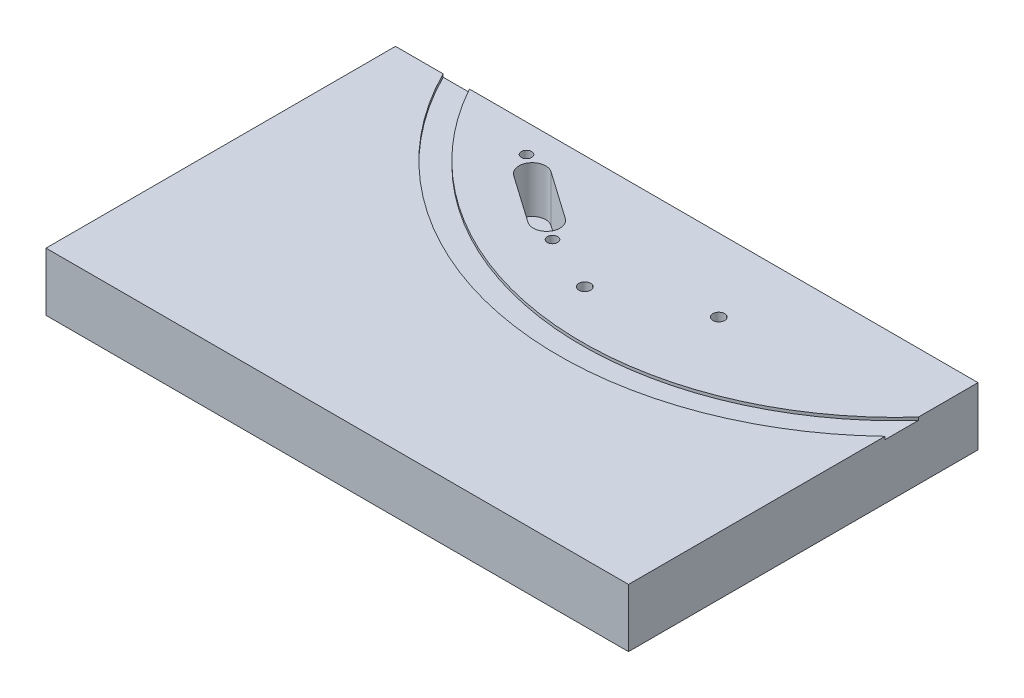
ISO-10303-21;
HEADER;
FILE_DESCRIPTION(('STEP AP214'),'2;1');
FILE_NAME('part.step','',(''),(''),'','','');
FILE_SCHEMA(('AUTOMOTIVE_DESIGN { 1 0 10303 214 1 1 1 1 }'));
ENDSEC;
DATA;
#1=APPLICATION_CONTEXT('core data for automotive mechanical design processes');
#2=APPLICATION_PROTOCOL_DEFINITION('international standard','automotive_design',2000,#1);
#3=PRODUCT_CONTEXT('',#1,'mechanical');
#4=PRODUCT('Part','Part','',(#3));
#5=PRODUCT_RELATED_PRODUCT_CATEGORY('part','',(#4));
#6=PRODUCT_DEFINITION_FORMATION('','',#4);
#7=PRODUCT_DEFINITION_CONTEXT('part definition',#1,'design');
#8=PRODUCT_DEFINITION('design','',#6,#7);
#9=PRODUCT_DEFINITION_SHAPE('','',#8);
#10=(LENGTH_UNIT() NAMED_UNIT(*) SI_UNIT(.MILLI.,.METRE.));
#11=(NAMED_UNIT(*) PLANE_ANGLE_UNIT() SI_UNIT($,.RADIAN.));
#12=(NAMED_UNIT(*) SI_UNIT($,.STERADIAN.) SOLID_ANGLE_UNIT());
#13=UNCERTAINTY_MEASURE_WITH_UNIT(LENGTH_MEASURE(1.E-05),#10,'distance_accuracy_value','');
#14=(GEOMETRIC_REPRESENTATION_CONTEXT(3) GLOBAL_UNCERTAINTY_ASSIGNED_CONTEXT((#13)) GLOBAL_UNIT_ASSIGNED_CONTEXT((#10,
#11,#12)) REPRESENTATION_CONTEXT('',''));
#15=CARTESIAN_POINT('',(0.,0.,0.));
#16=DIRECTION('',(0.,0.,1.));
#17=DIRECTION('',(1.,0.,0.));
#18=AXIS2_PLACEMENT_3D('',#15,#16,#17);
#19=CARTESIAN_POINT('',(0.,10.,0.));
#20=DIRECTION('',(0.,1.,0.));
#21=DIRECTION('',(0.,0.,1.));
#22=AXIS2_PLACEMENT_3D('',#19,#20,#21);
#23=PLANE('',#22);
#24=CARTESIAN_POINT('',(60.,10.,-26.));
#25=DIRECTION('',(0.,1.,0.));
#26=DIRECTION('',(0.,0.,-1.));
#27=AXIS2_PLACEMENT_3D('',#24,#25,#26);
#28=CIRCLE('',#27,57.975);
#29=CARTESIAN_POINT('',(8.182043411574,10.,0.));
#30=VERTEX_POINT('',#29);
#31=CARTESIAN_POINT('',(100.,10.,15.9654694361924));
#32=VERTEX_POINT('',#31);
#33=EDGE_CURVE('E160',#30,#32,#28,.T.);
#34=ORIENTED_EDGE('',*,*,#33,.F.);
#35=DIRECTION('',(-1.,0.,0.));
#36=VECTOR('',#35,1.);
#37=CARTESIAN_POINT('',(0.,10.,0.));
#38=LINE('',#37,#36);
#39=CARTESIAN_POINT('',(0.,10.,0.));
#40=VERTEX_POINT('',#39);
#41=EDGE_CURVE('E249',#30,#40,#38,.T.);
#42=ORIENTED_EDGE('',*,*,#41,.T.);
#43=DIRECTION('',(0.,0.,1.));
#44=VECTOR('',#43,1.);
#45=CARTESIAN_POINT('',(0.,10.,0.));
#46=LINE('',#45,#44);
#47=CARTESIAN_POINT('',(0.,10.,60.));
#48=VERTEX_POINT('',#47);
#49=EDGE_CURVE('E240',#40,#48,#46,.T.);
#50=ORIENTED_EDGE('',*,*,#49,.T.);
#51=DIRECTION('',(1.,0.,0.));
#52=VECTOR('',#51,1.);
#53=CARTESIAN_POINT('',(0.,10.,60.));
#54=LINE('',#53,#52);
#55=CARTESIAN_POINT('',(100.,10.,60.));
#56=VERTEX_POINT('',#55);
#57=EDGE_CURVE('E243',#48,#56,#54,.T.);
#58=ORIENTED_EDGE('',*,*,#57,.T.);
#59=DIRECTION('',(0.,0.,-1.));
#60=VECTOR('',#59,1.);
#61=CARTESIAN_POINT('',(100.,10.,0.));
#62=LINE('',#61,#60);
#63=EDGE_CURVE('E246',#56,#32,#62,.T.);
#64=ORIENTED_EDGE('',*,*,#63,.T.);
#65=EDGE_LOOP('',(#34,#42,#50,#58,#64));
#66=FACE_BOUND('',#65,.T.);
#67=ADVANCED_FACE('F38',(#66),#23,.T.);
#68=CARTESIAN_POINT('',(68.,10.,12.5));
#69=DIRECTION('',(0.,1.,0.));
#70=DIRECTION('',(0.,0.,1.));
#71=AXIS2_PLACEMENT_3D('',#68,#69,#70);
#72=CIRCLE('',#71,1.025);
#73=CARTESIAN_POINT('',(68.,10.,13.525));
#74=VERTEX_POINT('',#73);
#75=EDGE_CURVE('E233',#74,#74,#72,.T.);
#76=ORIENTED_EDGE('',*,*,#75,.F.);
#77=EDGE_LOOP('',(#76));
#78=FACE_BOUND('',#77,.T.);
#79=CARTESIAN_POINT('',(52.,10.,19.5));
#80=DIRECTION('',(0.,1.,0.));
#81=DIRECTION('',(0.,0.,1.));
#82=AXIS2_PLACEMENT_3D('',#79,#80,#81);
#83=CIRCLE('',#82,1.025);
#84=CARTESIAN_POINT('',(52.,10.,20.525));
#85=VERTEX_POINT('',#84);
#86=EDGE_CURVE('E227',#85,#85,#83,.T.);
#87=ORIENTED_EDGE('',*,*,#86,.F.);
#88=EDGE_LOOP('',(#87));
#89=FACE_BOUND('',#88,.T.);
#90=CARTESIAN_POINT('',(27.324326662388,10.,4.83432911843016));
#91=DIRECTION('',(0.,1.,0.));
#92=DIRECTION('',(0.,0.,1.));
#93=AXIS2_PLACEMENT_3D('',#90,#91,#92);
#94=CIRCLE('',#93,0.889000000000001);
#95=CARTESIAN_POINT('',(27.324326662388,10.,5.72332911843016));
#96=VERTEX_POINT('',#95);
#97=EDGE_CURVE('E221',#96,#96,#94,.T.);
#98=ORIENTED_EDGE('',*,*,#97,.F.);
#99=EDGE_LOOP('',(#98));
#100=FACE_BOUND('',#99,.T.);
#101=CARTESIAN_POINT('',(42.2009469387204,10.,15.2510507790014));
#102=DIRECTION('',(0.,1.,0.));
#103=DIRECTION('',(0.,0.,1.));
#104=AXIS2_PLACEMENT_3D('',#101,#102,#103);
#105=CIRCLE('',#104,0.889000000000001);
#106=CARTESIAN_POINT('',(42.2009469387204,10.,16.1400507790014));
#107=VERTEX_POINT('',#106);
#108=EDGE_CURVE('E210',#107,#107,#105,.T.);
#109=ORIENTED_EDGE('',*,*,#108,.F.);
#110=EDGE_LOOP('',(#109));
#111=FACE_BOUND('',#110,.T.);
#112=CARTESIAN_POINT('',(38.8583970219992,10.,12.910572130471));
#113=DIRECTION('',(0.,1.,0.));
#114=DIRECTION('',(0.,0.,1.));
#115=AXIS2_PLACEMENT_3D('',#112,#113,#114);
#116=CIRCLE('',#115,2.3);
#117=CARTESIAN_POINT('',(37.5391712183918,10.,14.7946218323357));
#118=VERTEX_POINT('',#117);
#119=CARTESIAN_POINT('',(40.1776228256065,10.,11.0265224286063));
#120=VERTEX_POINT('',#119);
#121=EDGE_CURVE('E61',#118,#120,#116,.T.);
#122=ORIENTED_EDGE('',*,*,#121,.F.);
#123=DIRECTION('',(0.819152044288995,0.,0.573576436351041));
#124=VECTOR('',#123,1.);
#125=CARTESIAN_POINT('',(37.5391712183918,10.,14.7946218323357));
#126=LINE('',#125,#124);
#127=CARTESIAN_POINT('',(29.3476507755018,10.,9.05885746882527));
#128=VERTEX_POINT('',#127);
#129=EDGE_CURVE('E189',#128,#118,#126,.T.);
#130=ORIENTED_EDGE('',*,*,#129,.F.);
#131=CARTESIAN_POINT('',(30.6668765791092,10.,7.17480776696058));
#132=DIRECTION('',(0.,1.,0.));
#133=DIRECTION('',(0.,0.,1.));
#134=AXIS2_PLACEMENT_3D('',#131,#132,#133);
#135=CIRCLE('',#134,2.3);
#136=CARTESIAN_POINT('',(31.9861023827166,10.,5.29075806509589));
#137=VERTEX_POINT('',#136);
#138=EDGE_CURVE('E203',#137,#128,#135,.T.);
#139=ORIENTED_EDGE('',*,*,#138,.F.);
#140=DIRECTION('',(-0.819152044288995,0.,-0.573576436351041));
#141=VECTOR('',#140,1.);
#142=CARTESIAN_POINT('',(40.1776228256065,10.,11.0265224286063));
#143=LINE('',#142,#141);
#144=EDGE_CURVE('E200',#120,#137,#143,.T.);
#145=ORIENTED_EDGE('',*,*,#144,.F.);
#146=EDGE_LOOP('',(#122,#130,#139,#145));
#147=FACE_BOUND('',#146,.T.);
#148=CARTESIAN_POINT('',(60.,10.,-26.));
#149=DIRECTION('',(0.,-1.,0.));
#150=DIRECTION('',(0.,0.,-1.));
#151=AXIS2_PLACEMENT_3D('',#148,#149,#150);
#152=CIRCLE('',#151,53.975);
#153=CARTESIAN_POINT('',(100.,10.,10.2394898556809));
#154=VERTEX_POINT('',#153);
#155=CARTESIAN_POINT('',(12.6998876851228,10.,0.));
#156=VERTEX_POINT('',#155);
#157=EDGE_CURVE('E289',#154,#156,#152,.T.);
#158=ORIENTED_EDGE('',*,*,#157,.F.);
#159=CARTESIAN_POINT('',(100.,10.,0.));
#160=VERTEX_POINT('',#159);
#161=EDGE_CURVE('E165',#154,#160,#62,.T.);
#162=ORIENTED_EDGE('',*,*,#161,.T.);
#163=EDGE_CURVE('E250',#160,#156,#38,.T.);
#164=ORIENTED_EDGE('',*,*,#163,.T.);
#165=EDGE_LOOP('',(#158,#162,#164));
#166=FACE_BOUND('',#165,.T.);
#167=ADVANCED_FACE('F288',(#78,#89,#100,#111,#147,#166),#23,.T.);
#168=CARTESIAN_POINT('',(0.,10.,0.));
#169=DIRECTION('',(1.,0.,0.));
#170=DIRECTION('',(0.,0.,-1.));
#171=AXIS2_PLACEMENT_3D('',#168,#169,#170);
#172=PLANE('',#171);
#173=DIRECTION('',(0.,0.,1.));
#174=VECTOR('',#173,1.);
#175=CARTESIAN_POINT('',(0.,0.,0.));
#176=LINE('',#175,#174);
#177=CARTESIAN_POINT('',(0.,0.,0.));
#178=VERTEX_POINT('',#177);
#179=CARTESIAN_POINT('',(0.,0.,60.));
#180=VERTEX_POINT('',#179);
#181=EDGE_CURVE('E239',#178,#180,#176,.T.);
#182=ORIENTED_EDGE('',*,*,#181,.T.);
#183=DIRECTION('',(0.,-1.,0.));
#184=VECTOR('',#183,1.);
#185=CARTESIAN_POINT('',(0.,10.,60.));
#186=LINE('',#185,#184);
#187=EDGE_CURVE('E46',#48,#180,#186,.T.);
#188=ORIENTED_EDGE('',*,*,#187,.F.);
#189=ORIENTED_EDGE('',*,*,#49,.F.);
#190=DIRECTION('',(0.,-1.,0.));
#191=VECTOR('',#190,1.);
#192=CARTESIAN_POINT('',(0.,10.,0.));
#193=LINE('',#192,#191);
#194=EDGE_CURVE('E253',#40,#178,#193,.T.);
#195=ORIENTED_EDGE('',*,*,#194,.T.);
#196=EDGE_LOOP('',(#182,#188,#189,#195));
#197=FACE_BOUND('',#196,.T.);
#198=ADVANCED_FACE('F40',(#197),#172,.F.);
#199=CARTESIAN_POINT('',(0.,10.,60.));
#200=DIRECTION('',(0.,0.,-1.));
#201=DIRECTION('',(-1.,0.,0.));
#202=AXIS2_PLACEMENT_3D('',#199,#200,#201);
#203=PLANE('',#202);
#204=DIRECTION('',(1.,0.,0.));
#205=VECTOR('',#204,1.);
#206=CARTESIAN_POINT('',(0.,0.,60.));
#207=LINE('',#206,#205);
#208=CARTESIAN_POINT('',(100.,0.,60.));
#209=VERTEX_POINT('',#208);
#210=EDGE_CURVE('E256',#180,#209,#207,.T.);
#211=ORIENTED_EDGE('',*,*,#210,.T.);
#212=DIRECTION('',(0.,-1.,0.));
#213=VECTOR('',#212,1.);
#214=CARTESIAN_POINT('',(100.,10.,60.));
#215=LINE('',#214,#213);
#216=EDGE_CURVE('E266',#56,#209,#215,.T.);
#217=ORIENTED_EDGE('',*,*,#216,.F.);
#218=ORIENTED_EDGE('',*,*,#57,.F.);
#219=ORIENTED_EDGE('',*,*,#187,.T.);
#220=EDGE_LOOP('',(#211,#217,#218,#219));
#221=FACE_BOUND('',#220,.T.);
#222=ADVANCED_FACE('F271',(#221),#203,.F.);
#223=CARTESIAN_POINT('',(100.,10.,0.));
#224=DIRECTION('',(-1.,0.,0.));
#225=DIRECTION('',(0.,0.,1.));
#226=AXIS2_PLACEMENT_3D('',#223,#224,#225);
#227=PLANE('',#226);
#228=DIRECTION('',(0.,0.,1.));
#229=VECTOR('',#228,1.);
#230=CARTESIAN_POINT('',(100.,9.5,0.));
#231=LINE('',#230,#229);
#232=CARTESIAN_POINT('',(100.,9.5,10.2394898556809));
#233=VERTEX_POINT('',#232);
#234=CARTESIAN_POINT('',(100.,9.5,15.9654694361924));
#235=VERTEX_POINT('',#234);
#236=EDGE_CURVE('E147',#233,#235,#231,.T.);
#237=ORIENTED_EDGE('',*,*,#236,.T.);
#238=DIRECTION('',(0.,1.,0.));
#239=VECTOR('',#238,1.);
#240=CARTESIAN_POINT('',(100.,9.5,15.9654694361924));
#241=LINE('',#240,#239);
#242=EDGE_CURVE('E155',#235,#32,#241,.T.);
#243=ORIENTED_EDGE('',*,*,#242,.T.);
#244=ORIENTED_EDGE('',*,*,#63,.F.);
#245=ORIENTED_EDGE('',*,*,#216,.T.);
#246=DIRECTION('',(0.,0.,-1.));
#247=VECTOR('',#246,1.);
#248=CARTESIAN_POINT('',(100.,0.,0.));
#249=LINE('',#248,#247);
#250=CARTESIAN_POINT('',(100.,0.,0.));
#251=VERTEX_POINT('',#250);
#252=EDGE_CURVE('E258',#209,#251,#249,.T.);
#253=ORIENTED_EDGE('',*,*,#252,.T.);
#254=DIRECTION('',(0.,-1.,0.));
#255=VECTOR('',#254,1.);
#256=CARTESIAN_POINT('',(100.,10.,0.));
#257=LINE('',#256,#255);
#258=EDGE_CURVE('E263',#160,#251,#257,.T.);
#259=ORIENTED_EDGE('',*,*,#258,.F.);
#260=ORIENTED_EDGE('',*,*,#161,.F.);
#261=DIRECTION('',(0.,1.,0.));
#262=VECTOR('',#261,1.);
#263=CARTESIAN_POINT('',(100.,9.5,10.2394898556809));
#264=LINE('',#263,#262);
#265=EDGE_CURVE('E53',#233,#154,#264,.T.);
#266=ORIENTED_EDGE('',*,*,#265,.F.);
#267=EDGE_LOOP('',(#237,#243,#244,#245,#253,#259,#260,#266));
#268=FACE_BOUND('',#267,.T.);
#269=ADVANCED_FACE('F163',(#268),#227,.F.);
#270=CARTESIAN_POINT('',(0.,10.,0.));
#271=DIRECTION('',(0.,0.,1.));
#272=DIRECTION('',(1.,0.,0.));
#273=AXIS2_PLACEMENT_3D('',#270,#271,#272);
#274=PLANE('',#273);
#275=ORIENTED_EDGE('',*,*,#41,.F.);
#276=DIRECTION('',(0.,1.,0.));
#277=VECTOR('',#276,1.);
#278=CARTESIAN_POINT('',(8.182043411574,9.5,0.));
#279=LINE('',#278,#277);
#280=CARTESIAN_POINT('',(8.182043411574,9.5,0.));
#281=VERTEX_POINT('',#280);
#282=EDGE_CURVE('E166',#281,#30,#279,.T.);
#283=ORIENTED_EDGE('',*,*,#282,.F.);
#284=DIRECTION('',(1.,0.,0.));
#285=VECTOR('',#284,1.);
#286=CARTESIAN_POINT('',(0.,9.5,0.));
#287=LINE('',#286,#285);
#288=CARTESIAN_POINT('',(12.6998876851228,9.5,0.));
#289=VERTEX_POINT('',#288);
#290=EDGE_CURVE('E11',#281,#289,#287,.T.);
#291=ORIENTED_EDGE('',*,*,#290,.T.);
#292=DIRECTION('',(0.,1.,0.));
#293=VECTOR('',#292,1.);
#294=CARTESIAN_POINT('',(12.6998876851228,9.5,0.));
#295=LINE('',#294,#293);
#296=EDGE_CURVE('E159',#289,#156,#295,.T.);
#297=ORIENTED_EDGE('',*,*,#296,.T.);
#298=ORIENTED_EDGE('',*,*,#163,.F.);
#299=ORIENTED_EDGE('',*,*,#258,.T.);
#300=DIRECTION('',(-1.,0.,0.));
#301=VECTOR('',#300,1.);
#302=CARTESIAN_POINT('',(0.,0.,0.));
#303=LINE('',#302,#301);
#304=EDGE_CURVE('E244',#251,#178,#303,.T.);
#305=ORIENTED_EDGE('',*,*,#304,.T.);
#306=ORIENTED_EDGE('',*,*,#194,.F.);
#307=EDGE_LOOP('',(#275,#283,#291,#297,#298,#299,#305,#306));
#308=FACE_BOUND('',#307,.T.);
#309=CARTESIAN_POINT('',(70.,5.,0.));
#310=DIRECTION('',(0.,0.,-1.));
#311=DIRECTION('',(-1.,0.,0.));
#312=AXIS2_PLACEMENT_3D('',#309,#310,#311);
#313=CIRCLE('',#312,1.25);
#314=CARTESIAN_POINT('',(68.75,5.,0.));
#315=VERTEX_POINT('',#314);
#316=EDGE_CURVE('E154',#315,#315,#313,.T.);
#317=ORIENTED_EDGE('',*,*,#316,.F.);
#318=EDGE_LOOP('',(#317));
#319=FACE_BOUND('',#318,.T.);
#320=CARTESIAN_POINT('',(20.,5.,0.));
#321=DIRECTION('',(0.,0.,-1.));
#322=DIRECTION('',(-1.,0.,0.));
#323=AXIS2_PLACEMENT_3D('',#320,#321,#322);
#324=CIRCLE('',#323,1.25);
#325=CARTESIAN_POINT('',(18.75,5.,0.));
#326=VERTEX_POINT('',#325);
#327=EDGE_CURVE('E179',#326,#326,#324,.T.);
#328=ORIENTED_EDGE('',*,*,#327,.F.);
#329=EDGE_LOOP('',(#328));
#330=FACE_BOUND('',#329,.T.);
#331=ADVANCED_FACE('F285',(#308,#319,#330),#274,.F.);
#332=CARTESIAN_POINT('',(0.,0.,0.));
#333=DIRECTION('',(0.,1.,0.));
#334=DIRECTION('',(0.,0.,1.));
#335=AXIS2_PLACEMENT_3D('',#332,#333,#334);
#336=PLANE('',#335);
#337=ORIENTED_EDGE('',*,*,#181,.F.);
#338=ORIENTED_EDGE('',*,*,#304,.F.);
#339=ORIENTED_EDGE('',*,*,#252,.F.);
#340=ORIENTED_EDGE('',*,*,#210,.F.);
#341=EDGE_LOOP('',(#337,#338,#339,#340));
#342=FACE_BOUND('',#341,.T.);
#343=ADVANCED_FACE('F279',(#342),#336,.F.);
#344=CARTESIAN_POINT('',(68.,3.65,12.5));
#345=DIRECTION('',(0.,1.,0.));
#346=DIRECTION('',(0.,0.,1.));
#347=AXIS2_PLACEMENT_3D('',#344,#345,#346);
#348=CONICAL_SURFACE('',#347,1.025,1.02974425867665);
#349=CARTESIAN_POINT('',(68.,3.03411786549675,12.5));
#350=VERTEX_POINT('',#349);
#351=VERTEX_LOOP('',#350);
#352=FACE_BOUND('',#351,.T.);
#353=CARTESIAN_POINT('',(68.,3.65,12.5));
#354=DIRECTION('',(0.,1.,0.));
#355=DIRECTION('',(0.,0.,1.));
#356=AXIS2_PLACEMENT_3D('',#353,#354,#355);
#357=CIRCLE('',#356,1.025);
#358=CARTESIAN_POINT('',(68.,3.65,13.525));
#359=VERTEX_POINT('',#358);
#360=EDGE_CURVE('E236',#359,#359,#357,.T.);
#361=ORIENTED_EDGE('',*,*,#360,.T.);
#362=EDGE_LOOP('',(#361));
#363=FACE_BOUND('',#362,.T.);
#364=ADVANCED_FACE('F304',(#352,#363),#348,.F.);
#365=CARTESIAN_POINT('',(68.,10.,12.5));
#366=DIRECTION('',(0.,1.,0.));
#367=DIRECTION('',(0.,0.,1.));
#368=AXIS2_PLACEMENT_3D('',#365,#366,#367);
#369=CYLINDRICAL_SURFACE('',#368,1.025);
#370=ORIENTED_EDGE('',*,*,#360,.F.);
#371=EDGE_LOOP('',(#370));
#372=FACE_BOUND('',#371,.T.);
#373=ORIENTED_EDGE('',*,*,#75,.T.);
#374=EDGE_LOOP('',(#373));
#375=FACE_BOUND('',#374,.T.);
#376=ADVANCED_FACE('F425',(#372,#375),#369,.F.);
#377=CARTESIAN_POINT('',(52.,3.65,19.5));
#378=DIRECTION('',(0.,1.,0.));
#379=DIRECTION('',(0.,0.,1.));
#380=AXIS2_PLACEMENT_3D('',#377,#378,#379);
#381=CONICAL_SURFACE('',#380,1.025,1.02974425867665);
#382=CARTESIAN_POINT('',(52.,3.03411786549675,19.5));
#383=VERTEX_POINT('',#382);
#384=VERTEX_LOOP('',#383);
#385=FACE_BOUND('',#384,.T.);
#386=CARTESIAN_POINT('',(52.,3.65,19.5));
#387=DIRECTION('',(0.,1.,0.));
#388=DIRECTION('',(0.,0.,1.));
#389=AXIS2_PLACEMENT_3D('',#386,#387,#388);
#390=CIRCLE('',#389,1.025);
#391=CARTESIAN_POINT('',(52.,3.65,20.525));
#392=VERTEX_POINT('',#391);
#393=EDGE_CURVE('E230',#392,#392,#390,.T.);
#394=ORIENTED_EDGE('',*,*,#393,.T.);
#395=EDGE_LOOP('',(#394));
#396=FACE_BOUND('',#395,.T.);
#397=ADVANCED_FACE('F422',(#385,#396),#381,.F.);
#398=CARTESIAN_POINT('',(52.,10.,19.5));
#399=DIRECTION('',(0.,1.,0.));
#400=DIRECTION('',(0.,0.,1.));
#401=AXIS2_PLACEMENT_3D('',#398,#399,#400);
#402=CYLINDRICAL_SURFACE('',#401,1.025);
#403=ORIENTED_EDGE('',*,*,#393,.F.);
#404=EDGE_LOOP('',(#403));
#405=FACE_BOUND('',#404,.T.);
#406=ORIENTED_EDGE('',*,*,#86,.T.);
#407=EDGE_LOOP('',(#406));
#408=FACE_BOUND('',#407,.T.);
#409=ADVANCED_FACE('F418',(#405,#408),#402,.F.);
#410=CARTESIAN_POINT('',(27.324326662388,4.27,4.83432911843016));
#411=DIRECTION('',(0.,1.,0.));
#412=DIRECTION('',(0.,0.,1.));
#413=AXIS2_PLACEMENT_3D('',#410,#411,#412);
#414=CONICAL_SURFACE('',#413,0.888999999999997,1.02974425867665);
#415=CARTESIAN_POINT('',(27.324326662388,3.7358349096845,4.83432911843016));
#416=VERTEX_POINT('',#415);
#417=VERTEX_LOOP('',#416);
#418=FACE_BOUND('',#417,.T.);
#419=CARTESIAN_POINT('',(27.324326662388,4.27,4.83432911843016));
#420=DIRECTION('',(0.,1.,0.));
#421=DIRECTION('',(0.,0.,1.));
#422=AXIS2_PLACEMENT_3D('',#419,#420,#421);
#423=CIRCLE('',#422,0.888999999999997);
#424=CARTESIAN_POINT('',(27.324326662388,4.27,5.72332911843015));
#425=VERTEX_POINT('',#424);
#426=EDGE_CURVE('E224',#425,#425,#423,.T.);
#427=ORIENTED_EDGE('',*,*,#426,.T.);
#428=EDGE_LOOP('',(#427));
#429=FACE_BOUND('',#428,.T.);
#430=ADVANCED_FACE('F414',(#418,#429),#414,.F.);
#431=CARTESIAN_POINT('',(27.324326662388,10.,4.83432911843016));
#432=DIRECTION('',(0.,1.,0.));
#433=DIRECTION('',(0.,0.,1.));
#434=AXIS2_PLACEMENT_3D('',#431,#432,#433);
#435=CYLINDRICAL_SURFACE('',#434,0.888999999999999);
#436=ORIENTED_EDGE('',*,*,#426,.F.);
#437=EDGE_LOOP('',(#436));
#438=FACE_BOUND('',#437,.T.);
#439=ORIENTED_EDGE('',*,*,#97,.T.);
#440=EDGE_LOOP('',(#439));
#441=FACE_BOUND('',#440,.T.);
#442=ADVANCED_FACE('F410',(#438,#441),#435,.F.);
#443=CARTESIAN_POINT('',(42.2009469387204,4.27,15.2510507790014));
#444=DIRECTION('',(0.,1.,0.));
#445=DIRECTION('',(0.,0.,1.));
#446=AXIS2_PLACEMENT_3D('',#443,#444,#445);
#447=CONICAL_SURFACE('',#446,0.889000000000001,1.02974425867666);
#448=CARTESIAN_POINT('',(42.2009469387204,3.7358349096845,15.2510507790014));
#449=VERTEX_POINT('',#448);
#450=VERTEX_LOOP('',#449);
#451=FACE_BOUND('',#450,.T.);
#452=CARTESIAN_POINT('',(42.2009469387204,4.27,15.2510507790014));
#453=DIRECTION('',(0.,1.,0.));
#454=DIRECTION('',(0.,0.,1.));
#455=AXIS2_PLACEMENT_3D('',#452,#453,#454);
#456=CIRCLE('',#455,0.889000000000001);
#457=CARTESIAN_POINT('',(42.2009469387204,4.27,16.1400507790014));
#458=VERTEX_POINT('',#457);
#459=EDGE_CURVE('E218',#458,#458,#456,.T.);
#460=ORIENTED_EDGE('',*,*,#459,.T.);
#461=EDGE_LOOP('',(#460));
#462=FACE_BOUND('',#461,.T.);
#463=ADVANCED_FACE('F406',(#451,#462),#447,.F.);
#464=CARTESIAN_POINT('',(42.2009469387204,10.,15.2510507790014));
#465=DIRECTION('',(0.,1.,0.));
#466=DIRECTION('',(0.,0.,1.));
#467=AXIS2_PLACEMENT_3D('',#464,#465,#466);
#468=CYLINDRICAL_SURFACE('',#467,0.889000000000001);
#469=ORIENTED_EDGE('',*,*,#459,.F.);
#470=EDGE_LOOP('',(#469));
#471=FACE_BOUND('',#470,.T.);
#472=ORIENTED_EDGE('',*,*,#108,.T.);
#473=EDGE_LOOP('',(#472));
#474=FACE_BOUND('',#473,.T.);
#475=ADVANCED_FACE('F403',(#471,#474),#468,.F.);
#476=CARTESIAN_POINT('',(38.8583970219992,2.,12.910572130471));
#477=DIRECTION('',(0.,1.,0.));
#478=DIRECTION('',(0.,0.,1.));
#479=AXIS2_PLACEMENT_3D('',#476,#477,#478);
#480=CYLINDRICAL_SURFACE('',#479,2.3);
#481=ORIENTED_EDGE('',*,*,#121,.T.);
#482=DIRECTION('',(0.,1.,0.));
#483=VECTOR('',#482,1.);
#484=CARTESIAN_POINT('',(40.1776228256065,2.,11.0265224286063));
#485=LINE('',#484,#483);
#486=CARTESIAN_POINT('',(40.1776228256065,2.,11.0265224286063));
#487=VERTEX_POINT('',#486);
#488=EDGE_CURVE('E198',#487,#120,#485,.T.);
#489=ORIENTED_EDGE('',*,*,#488,.F.);
#490=CARTESIAN_POINT('',(38.8583970219992,2.,12.910572130471));
#491=DIRECTION('',(0.,1.,0.));
#492=DIRECTION('',(0.,0.,1.));
#493=AXIS2_PLACEMENT_3D('',#490,#491,#492);
#494=CIRCLE('',#493,2.3);
#495=CARTESIAN_POINT('',(37.5391712183918,2.,14.7946218323357));
#496=VERTEX_POINT('',#495);
#497=EDGE_CURVE('E185',#496,#487,#494,.T.);
#498=ORIENTED_EDGE('',*,*,#497,.F.);
#499=DIRECTION('',(0.,1.,0.));
#500=VECTOR('',#499,1.);
#501=CARTESIAN_POINT('',(37.5391712183918,2.,14.7946218323357));
#502=LINE('',#501,#500);
#503=EDGE_CURVE('E208',#496,#118,#502,.T.);
#504=ORIENTED_EDGE('',*,*,#503,.T.);
#505=EDGE_LOOP('',(#481,#489,#498,#504));
#506=FACE_BOUND('',#505,.T.);
#507=ADVANCED_FACE('F393',(#506),#480,.F.);
#508=CARTESIAN_POINT('',(37.5391712183918,2.,14.7946218323357));
#509=DIRECTION('',(-0.573576436351041,0.,0.819152044288995));
#510=DIRECTION('',(0.819152044288995,0.,0.573576436351041));
#511=AXIS2_PLACEMENT_3D('',#508,#509,#510);
#512=PLANE('',#511);
#513=ORIENTED_EDGE('',*,*,#129,.T.);
#514=ORIENTED_EDGE('',*,*,#503,.F.);
#515=DIRECTION('',(0.819152044288995,0.,0.573576436351041));
#516=VECTOR('',#515,1.);
#517=CARTESIAN_POINT('',(37.5391712183918,2.,14.7946218323357));
#518=LINE('',#517,#516);
#519=CARTESIAN_POINT('',(29.3476507755018,2.,9.05885746882527));
#520=VERTEX_POINT('',#519);
#521=EDGE_CURVE('E195',#520,#496,#518,.T.);
#522=ORIENTED_EDGE('',*,*,#521,.F.);
#523=DIRECTION('',(0.,1.,0.));
#524=VECTOR('',#523,1.);
#525=CARTESIAN_POINT('',(29.3476507755018,2.,9.05885746882527));
#526=LINE('',#525,#524);
#527=EDGE_CURVE('E211',#520,#128,#526,.T.);
#528=ORIENTED_EDGE('',*,*,#527,.T.);
#529=EDGE_LOOP('',(#513,#514,#522,#528));
#530=FACE_BOUND('',#529,.T.);
#531=ADVANCED_FACE('F389',(#530),#512,.F.);
#532=CARTESIAN_POINT('',(30.6668765791092,2.,7.17480776696058));
#533=DIRECTION('',(0.,1.,0.));
#534=DIRECTION('',(0.,0.,1.));
#535=AXIS2_PLACEMENT_3D('',#532,#533,#534);
#536=CYLINDRICAL_SURFACE('',#535,2.3);
#537=ORIENTED_EDGE('',*,*,#138,.T.);
#538=ORIENTED_EDGE('',*,*,#527,.F.);
#539=CARTESIAN_POINT('',(30.6668765791092,2.,7.17480776696058));
#540=DIRECTION('',(0.,1.,0.));
#541=DIRECTION('',(0.,0.,1.));
#542=AXIS2_PLACEMENT_3D('',#539,#540,#541);
#543=CIRCLE('',#542,2.3);
#544=CARTESIAN_POINT('',(31.9861023827166,2.,5.29075806509589));
#545=VERTEX_POINT('',#544);
#546=EDGE_CURVE('E192',#545,#520,#543,.T.);
#547=ORIENTED_EDGE('',*,*,#546,.F.);
#548=DIRECTION('',(0.,1.,0.));
#549=VECTOR('',#548,1.);
#550=CARTESIAN_POINT('',(31.9861023827166,2.,5.29075806509589));
#551=LINE('',#550,#549);
#552=EDGE_CURVE('E213',#545,#137,#551,.T.);
#553=ORIENTED_EDGE('',*,*,#552,.T.);
#554=EDGE_LOOP('',(#537,#538,#547,#553));
#555=FACE_BOUND('',#554,.T.);
#556=ADVANCED_FACE('F392',(#555),#536,.F.);
#557=CARTESIAN_POINT('',(40.1776228256065,2.,11.0265224286063));
#558=DIRECTION('',(0.573576436351041,0.,-0.819152044288995));
#559=DIRECTION('',(-0.819152044288995,0.,-0.573576436351041));
#560=AXIS2_PLACEMENT_3D('',#557,#558,#559);
#561=PLANE('',#560);
#562=ORIENTED_EDGE('',*,*,#144,.T.);
#563=ORIENTED_EDGE('',*,*,#552,.F.);
#564=DIRECTION('',(-0.819152044288995,0.,-0.573576436351041));
#565=VECTOR('',#564,1.);
#566=CARTESIAN_POINT('',(40.1776228256065,2.,11.0265224286063));
#567=LINE('',#566,#565);
#568=EDGE_CURVE('E188',#487,#545,#567,.T.);
#569=ORIENTED_EDGE('',*,*,#568,.F.);
#570=ORIENTED_EDGE('',*,*,#488,.T.);
#571=EDGE_LOOP('',(#562,#563,#569,#570));
#572=FACE_BOUND('',#571,.T.);
#573=ADVANCED_FACE('F387',(#572),#561,.F.);
#574=CARTESIAN_POINT('',(38.8583970219992,2.,12.910572130471));
#575=DIRECTION('',(0.,1.,0.));
#576=DIRECTION('',(0.,0.,1.));
#577=AXIS2_PLACEMENT_3D('',#574,#575,#576);
#578=PLANE('',#577);
#579=ORIENTED_EDGE('',*,*,#497,.T.);
#580=ORIENTED_EDGE('',*,*,#568,.T.);
#581=ORIENTED_EDGE('',*,*,#546,.T.);
#582=ORIENTED_EDGE('',*,*,#521,.T.);
#583=EDGE_LOOP('',(#579,#580,#581,#582));
#584=FACE_BOUND('',#583,.T.);
#585=ADVANCED_FACE('F383',(#584),#578,.T.);
#586=CARTESIAN_POINT('',(20.,5.,7.5));
#587=DIRECTION('',(0.,0.,-1.));
#588=DIRECTION('',(-1.,0.,0.));
#589=AXIS2_PLACEMENT_3D('',#586,#587,#588);
#590=CONICAL_SURFACE('',#589,1.25,1.02974425867665);
#591=CARTESIAN_POINT('',(20.,5.,8.25107577378445));
#592=VERTEX_POINT('',#591);
#593=VERTEX_LOOP('',#592);
#594=FACE_BOUND('',#593,.T.);
#595=CARTESIAN_POINT('',(20.,5.,7.5));
#596=DIRECTION('',(0.,0.,-1.));
#597=DIRECTION('',(-1.,0.,0.));
#598=AXIS2_PLACEMENT_3D('',#595,#596,#597);
#599=CIRCLE('',#598,1.25);
#600=CARTESIAN_POINT('',(18.75,5.,7.5));
#601=VERTEX_POINT('',#600);
#602=EDGE_CURVE('E182',#601,#601,#599,.T.);
#603=ORIENTED_EDGE('',*,*,#602,.T.);
#604=EDGE_LOOP('',(#603));
#605=FACE_BOUND('',#604,.T.);
#606=ADVANCED_FACE('F379',(#594,#605),#590,.F.);
#607=CARTESIAN_POINT('',(20.,5.,0.));
#608=DIRECTION('',(0.,0.,-1.));
#609=DIRECTION('',(-1.,0.,0.));
#610=AXIS2_PLACEMENT_3D('',#607,#608,#609);
#611=CYLINDRICAL_SURFACE('',#610,1.25);
#612=ORIENTED_EDGE('',*,*,#602,.F.);
#613=EDGE_LOOP('',(#612));
#614=FACE_BOUND('',#613,.T.);
#615=ORIENTED_EDGE('',*,*,#327,.T.);
#616=EDGE_LOOP('',(#615));
#617=FACE_BOUND('',#616,.T.);
#618=ADVANCED_FACE('F375',(#614,#617),#611,.F.);
#619=CARTESIAN_POINT('',(70.,5.,7.5));
#620=DIRECTION('',(0.,0.,-1.));
#621=DIRECTION('',(-1.,0.,0.));
#622=AXIS2_PLACEMENT_3D('',#619,#620,#621);
#623=CONICAL_SURFACE('',#622,1.25,1.02974425867666);
#624=CARTESIAN_POINT('',(70.,5.,8.25107577378445));
#625=VERTEX_POINT('',#624);
#626=VERTEX_LOOP('',#625);
#627=FACE_BOUND('',#626,.T.);
#628=CARTESIAN_POINT('',(70.,5.,7.5));
#629=DIRECTION('',(0.,0.,-1.));
#630=DIRECTION('',(-1.,0.,0.));
#631=AXIS2_PLACEMENT_3D('',#628,#629,#630);
#632=CIRCLE('',#631,1.25);
#633=CARTESIAN_POINT('',(68.75,5.,7.5));
#634=VERTEX_POINT('',#633);
#635=EDGE_CURVE('E176',#634,#634,#632,.T.);
#636=ORIENTED_EDGE('',*,*,#635,.T.);
#637=EDGE_LOOP('',(#636));
#638=FACE_BOUND('',#637,.T.);
#639=ADVANCED_FACE('F371',(#627,#638),#623,.F.);
#640=CARTESIAN_POINT('',(70.,5.,0.));
#641=DIRECTION('',(0.,0.,-1.));
#642=DIRECTION('',(-1.,0.,0.));
#643=AXIS2_PLACEMENT_3D('',#640,#641,#642);
#644=CYLINDRICAL_SURFACE('',#643,1.25);
#645=ORIENTED_EDGE('',*,*,#635,.F.);
#646=EDGE_LOOP('',(#645));
#647=FACE_BOUND('',#646,.T.);
#648=ORIENTED_EDGE('',*,*,#316,.T.);
#649=EDGE_LOOP('',(#648));
#650=FACE_BOUND('',#649,.T.);
#651=ADVANCED_FACE('F348',(#647,#650),#644,.F.);
#652=CARTESIAN_POINT('',(80.7410838351089,9.5,-7.20884256904367));
#653=DIRECTION('',(0.,-1.,0.));
#654=DIRECTION('',(0.,0.,-1.));
#655=AXIS2_PLACEMENT_3D('',#652,#653,#654);
#656=PLANE('',#655);
#657=CARTESIAN_POINT('',(60.,9.5,-26.));
#658=DIRECTION('',(0.,-1.,0.));
#659=DIRECTION('',(0.,0.,-1.));
#660=AXIS2_PLACEMENT_3D('',#657,#658,#659);
#661=CIRCLE('',#660,53.975);
#662=EDGE_CURVE('E149',#233,#289,#661,.T.);
#663=ORIENTED_EDGE('',*,*,#662,.T.);
#664=ORIENTED_EDGE('',*,*,#290,.F.);
#665=CARTESIAN_POINT('',(60.,9.5,-26.));
#666=DIRECTION('',(0.,1.,0.));
#667=DIRECTION('',(0.,0.,-1.));
#668=AXIS2_PLACEMENT_3D('',#665,#666,#667);
#669=CIRCLE('',#668,57.975);
#670=EDGE_CURVE('E151',#281,#235,#669,.T.);
#671=ORIENTED_EDGE('',*,*,#670,.T.);
#672=ORIENTED_EDGE('',*,*,#236,.F.);
#673=EDGE_LOOP('',(#663,#664,#671,#672));
#674=FACE_BOUND('',#673,.T.);
#675=ADVANCED_FACE('F148',(#674),#656,.F.);
#676=CARTESIAN_POINT('',(60.,9.5,-26.));
#677=DIRECTION('',(0.,1.,0.));
#678=DIRECTION('',(0.,0.,1.));
#679=AXIS2_PLACEMENT_3D('',#676,#677,#678);
#680=CYLINDRICAL_SURFACE('',#679,57.975);
#681=ORIENTED_EDGE('',*,*,#670,.F.);
#682=ORIENTED_EDGE('',*,*,#282,.T.);
#683=ORIENTED_EDGE('',*,*,#33,.T.);
#684=ORIENTED_EDGE('',*,*,#242,.F.);
#685=EDGE_LOOP('',(#681,#682,#683,#684));
#686=FACE_BOUND('',#685,.T.);
#687=ADVANCED_FACE('F293',(#686),#680,.F.);
#688=CARTESIAN_POINT('',(60.,9.5,-26.));
#689=DIRECTION('',(0.,1.,0.));
#690=DIRECTION('',(0.,0.,1.));
#691=AXIS2_PLACEMENT_3D('',#688,#689,#690);
#692=CYLINDRICAL_SURFACE('',#691,53.975);
#693=ORIENTED_EDGE('',*,*,#662,.F.);
#694=ORIENTED_EDGE('',*,*,#265,.T.);
#695=ORIENTED_EDGE('',*,*,#157,.T.);
#696=ORIENTED_EDGE('',*,*,#296,.F.);
#697=EDGE_LOOP('',(#693,#694,#695,#696));
#698=FACE_BOUND('',#697,.T.);
#699=ADVANCED_FACE('F157',(#698),#692,.T.);
#700=CLOSED_SHELL('',(#67,#167,#198,#222,#269,#331,#343,#364,#376,#397,#409,#430,#442,#463,#475,
#507,#531,#556,#573,#585,#606,#618,#639,#651,#675,#687,#699));
#701=MANIFOLD_SOLID_BREP('B2',#700);
#702=ADVANCED_BREP_SHAPE_REPRESENTATION('',(#18,#701),#14);
#703=SHAPE_DEFINITION_REPRESENTATION(#9,#702);
ENDSEC;
END-ISO-10303-21;
